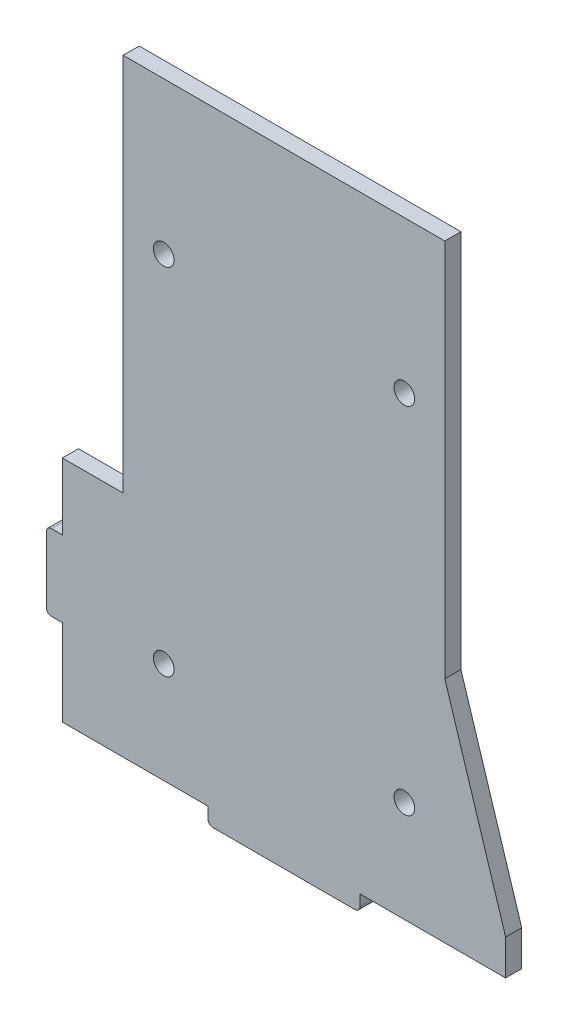
ISO-10303-21;
HEADER;
FILE_DESCRIPTION(('STEP AP214'),'2;1');
FILE_NAME('part.step','',(''),(''),'','','');
FILE_SCHEMA(('AUTOMOTIVE_DESIGN { 1 0 10303 214 1 1 1 1 }'));
ENDSEC;
DATA;
#1=APPLICATION_CONTEXT('core data for automotive mechanical design processes');
#2=APPLICATION_PROTOCOL_DEFINITION('international standard','automotive_design',2000,#1);
#3=PRODUCT_CONTEXT('',#1,'mechanical');
#4=PRODUCT('Part','Part','',(#3));
#5=PRODUCT_RELATED_PRODUCT_CATEGORY('part','',(#4));
#6=PRODUCT_DEFINITION_FORMATION('','',#4);
#7=PRODUCT_DEFINITION_CONTEXT('part definition',#1,'design');
#8=PRODUCT_DEFINITION('design','',#6,#7);
#9=PRODUCT_DEFINITION_SHAPE('','',#8);
#10=(LENGTH_UNIT() NAMED_UNIT(*) SI_UNIT(.MILLI.,.METRE.));
#11=(NAMED_UNIT(*) PLANE_ANGLE_UNIT() SI_UNIT($,.RADIAN.));
#12=(NAMED_UNIT(*) SI_UNIT($,.STERADIAN.) SOLID_ANGLE_UNIT());
#13=UNCERTAINTY_MEASURE_WITH_UNIT(LENGTH_MEASURE(1.E-05),#10,'distance_accuracy_value','');
#14=(GEOMETRIC_REPRESENTATION_CONTEXT(3) GLOBAL_UNCERTAINTY_ASSIGNED_CONTEXT((#13)) GLOBAL_UNIT_ASSIGNED_CONTEXT((#10,
#11,#12)) REPRESENTATION_CONTEXT('',''));
#15=CARTESIAN_POINT('',(0.,0.,0.));
#16=DIRECTION('',(0.,0.,1.));
#17=DIRECTION('',(1.,0.,0.));
#18=AXIS2_PLACEMENT_3D('',#15,#16,#17);
#19=CARTESIAN_POINT('',(-43.75,-53.,3.175));
#20=DIRECTION('',(1.,0.,0.));
#21=DIRECTION('',(0.,0.,-1.));
#22=AXIS2_PLACEMENT_3D('',#19,#20,#21);
#23=PLANE('',#22);
#24=DIRECTION('',(0.,0.,-1.));
#25=VECTOR('',#24,1.);
#26=CARTESIAN_POINT('',(-43.75,-28.,0.));
#27=LINE('',#26,#25);
#28=CARTESIAN_POINT('',(-43.75,-28.,3.175));
#29=VERTEX_POINT('',#28);
#30=CARTESIAN_POINT('',(-43.75,-28.,0.));
#31=VERTEX_POINT('',#30);
#32=EDGE_CURVE('E208',#29,#31,#27,.T.);
#33=ORIENTED_EDGE('',*,*,#32,.F.);
#34=DIRECTION('',(0.,-1.,0.));
#35=VECTOR('',#34,1.);
#36=CARTESIAN_POINT('',(-43.75,-14.8424319433222,3.175));
#37=LINE('',#36,#35);
#38=CARTESIAN_POINT('',(-43.75,-14.8424319433222,3.175));
#39=VERTEX_POINT('',#38);
#40=EDGE_CURVE('E202',#39,#29,#37,.T.);
#41=ORIENTED_EDGE('',*,*,#40,.F.);
#42=DIRECTION('',(0.,0.,-1.));
#43=VECTOR('',#42,1.);
#44=CARTESIAN_POINT('',(-43.75,-14.8424319433222,3.175));
#45=LINE('',#44,#43);
#46=CARTESIAN_POINT('',(-43.75,-14.8424319433222,0.));
#47=VERTEX_POINT('',#46);
#48=EDGE_CURVE('E355',#39,#47,#45,.T.);
#49=ORIENTED_EDGE('',*,*,#48,.T.);
#50=DIRECTION('',(0.,-1.,0.));
#51=VECTOR('',#50,1.);
#52=CARTESIAN_POINT('',(-43.75,-53.,0.));
#53=LINE('',#52,#51);
#54=EDGE_CURVE('E309',#47,#31,#53,.T.);
#55=ORIENTED_EDGE('',*,*,#54,.T.);
#56=EDGE_LOOP('',(#33,#41,#49,#55));
#57=FACE_BOUND('',#56,.T.);
#58=ADVANCED_FACE('F44',(#57),#23,.F.);
#59=DIRECTION('',(0.,0.,1.));
#60=VECTOR('',#59,1.);
#61=CARTESIAN_POINT('',(-43.75,-43.,0.));
#62=LINE('',#61,#60);
#63=CARTESIAN_POINT('',(-43.75,-43.,0.));
#64=VERTEX_POINT('',#63);
#65=CARTESIAN_POINT('',(-43.75,-43.,3.175));
#66=VERTEX_POINT('',#65);
#67=EDGE_CURVE('E196',#64,#66,#62,.T.);
#68=ORIENTED_EDGE('',*,*,#67,.F.);
#69=CARTESIAN_POINT('',(-43.75,-60.,0.));
#70=VERTEX_POINT('',#69);
#71=EDGE_CURVE('E308',#64,#70,#53,.T.);
#72=ORIENTED_EDGE('',*,*,#71,.T.);
#73=DIRECTION('',(0.,0.,-1.));
#74=VECTOR('',#73,1.);
#75=CARTESIAN_POINT('',(-43.75,-60.,3.175));
#76=LINE('',#75,#74);
#77=CARTESIAN_POINT('',(-43.75,-60.,3.175));
#78=VERTEX_POINT('',#77);
#79=EDGE_CURVE('E199',#78,#70,#76,.T.);
#80=ORIENTED_EDGE('',*,*,#79,.F.);
#81=EDGE_CURVE('E184',#66,#78,#37,.T.);
#82=ORIENTED_EDGE('',*,*,#81,.F.);
#83=EDGE_LOOP('',(#68,#72,#80,#82));
#84=FACE_BOUND('',#83,.T.);
#85=ADVANCED_FACE('F195',(#84),#23,.F.);
#86=CARTESIAN_POINT('',(31.75,-14.8424319433222,3.175));
#87=DIRECTION('',(-1.,0.,0.));
#88=DIRECTION('',(0.,0.,1.));
#89=AXIS2_PLACEMENT_3D('',#86,#87,#88);
#90=PLANE('',#89);
#91=DIRECTION('',(0.,1.,0.));
#92=VECTOR('',#91,1.);
#93=CARTESIAN_POINT('',(31.75,-14.8424319433222,0.));
#94=LINE('',#93,#92);
#95=CARTESIAN_POINT('',(31.75,-14.8424319433222,0.));
#96=VERTEX_POINT('',#95);
#97=CARTESIAN_POINT('',(31.75,60.,0.));
#98=VERTEX_POINT('',#97);
#99=EDGE_CURVE('E254',#96,#98,#94,.T.);
#100=ORIENTED_EDGE('',*,*,#99,.T.);
#101=DIRECTION('',(0.,0.,-1.));
#102=VECTOR('',#101,1.);
#103=CARTESIAN_POINT('',(31.75,60.,3.175));
#104=LINE('',#103,#102);
#105=CARTESIAN_POINT('',(31.75,60.,3.175));
#106=VERTEX_POINT('',#105);
#107=EDGE_CURVE('E367',#106,#98,#104,.T.);
#108=ORIENTED_EDGE('',*,*,#107,.F.);
#109=DIRECTION('',(0.,1.,0.));
#110=VECTOR('',#109,1.);
#111=CARTESIAN_POINT('',(31.75,-14.8424319433222,3.175));
#112=LINE('',#111,#110);
#113=CARTESIAN_POINT('',(31.75,-14.8424319433222,3.175));
#114=VERTEX_POINT('',#113);
#115=EDGE_CURVE('E258',#114,#106,#112,.T.);
#116=ORIENTED_EDGE('',*,*,#115,.F.);
#117=DIRECTION('',(0.,0.,-1.));
#118=VECTOR('',#117,1.);
#119=CARTESIAN_POINT('',(31.75,-14.8424319433222,3.175));
#120=LINE('',#119,#118);
#121=EDGE_CURVE('E294',#114,#96,#120,.T.);
#122=ORIENTED_EDGE('',*,*,#121,.T.);
#123=EDGE_LOOP('',(#100,#108,#116,#122));
#124=FACE_BOUND('',#123,.T.);
#125=ADVANCED_FACE('F474',(#124),#90,.F.);
#126=CARTESIAN_POINT('',(-31.75,60.,3.175));
#127=DIRECTION('',(0.,-1.,0.));
#128=DIRECTION('',(0.,0.,-1.));
#129=AXIS2_PLACEMENT_3D('',#126,#127,#128);
#130=PLANE('',#129);
#131=DIRECTION('',(-1.,0.,0.));
#132=VECTOR('',#131,1.);
#133=CARTESIAN_POINT('',(-31.75,60.,0.));
#134=LINE('',#133,#132);
#135=CARTESIAN_POINT('',(-31.75,60.,0.));
#136=VERTEX_POINT('',#135);
#137=EDGE_CURVE('E298',#98,#136,#134,.T.);
#138=ORIENTED_EDGE('',*,*,#137,.T.);
#139=DIRECTION('',(0.,0.,-1.));
#140=VECTOR('',#139,1.);
#141=CARTESIAN_POINT('',(-31.75,60.,3.175));
#142=LINE('',#141,#140);
#143=CARTESIAN_POINT('',(-31.75,60.,3.175));
#144=VERTEX_POINT('',#143);
#145=EDGE_CURVE('E363',#144,#136,#142,.T.);
#146=ORIENTED_EDGE('',*,*,#145,.F.);
#147=DIRECTION('',(-1.,0.,0.));
#148=VECTOR('',#147,1.);
#149=CARTESIAN_POINT('',(-31.75,60.,3.175));
#150=LINE('',#149,#148);
#151=EDGE_CURVE('E262',#106,#144,#150,.T.);
#152=ORIENTED_EDGE('',*,*,#151,.F.);
#153=ORIENTED_EDGE('',*,*,#107,.T.);
#154=EDGE_LOOP('',(#138,#146,#152,#153));
#155=FACE_BOUND('',#154,.T.);
#156=ADVANCED_FACE('F477',(#155),#130,.F.);
#157=CARTESIAN_POINT('',(-31.75,-14.8424319433222,3.175));
#158=DIRECTION('',(1.,0.,0.));
#159=DIRECTION('',(0.,0.,-1.));
#160=AXIS2_PLACEMENT_3D('',#157,#158,#159);
#161=PLANE('',#160);
#162=DIRECTION('',(0.,-1.,0.));
#163=VECTOR('',#162,1.);
#164=CARTESIAN_POINT('',(-31.75,-14.8424319433222,0.));
#165=LINE('',#164,#163);
#166=CARTESIAN_POINT('',(-31.75,-14.8424319433222,0.));
#167=VERTEX_POINT('',#166);
#168=EDGE_CURVE('E301',#136,#167,#165,.T.);
#169=ORIENTED_EDGE('',*,*,#168,.T.);
#170=DIRECTION('',(0.,0.,-1.));
#171=VECTOR('',#170,1.);
#172=CARTESIAN_POINT('',(-31.75,-14.8424319433222,3.175));
#173=LINE('',#172,#171);
#174=CARTESIAN_POINT('',(-31.75,-14.8424319433222,3.175));
#175=VERTEX_POINT('',#174);
#176=EDGE_CURVE('E359',#175,#167,#173,.T.);
#177=ORIENTED_EDGE('',*,*,#176,.F.);
#178=DIRECTION('',(0.,-1.,0.));
#179=VECTOR('',#178,1.);
#180=CARTESIAN_POINT('',(-31.75,-14.8424319433222,3.175));
#181=LINE('',#180,#179);
#182=EDGE_CURVE('E266',#144,#175,#181,.T.);
#183=ORIENTED_EDGE('',*,*,#182,.F.);
#184=ORIENTED_EDGE('',*,*,#145,.T.);
#185=EDGE_LOOP('',(#169,#177,#183,#184));
#186=FACE_BOUND('',#185,.T.);
#187=ADVANCED_FACE('F482',(#186),#161,.F.);
#188=CARTESIAN_POINT('',(-31.75,-14.8424319433222,3.175));
#189=DIRECTION('',(0.,-1.,0.));
#190=DIRECTION('',(0.,0.,-1.));
#191=AXIS2_PLACEMENT_3D('',#188,#189,#190);
#192=PLANE('',#191);
#193=DIRECTION('',(-1.,0.,0.));
#194=VECTOR('',#193,1.);
#195=CARTESIAN_POINT('',(-31.75,-14.8424319433222,0.));
#196=LINE('',#195,#194);
#197=EDGE_CURVE('E304',#167,#47,#196,.T.);
#198=ORIENTED_EDGE('',*,*,#197,.T.);
#199=ORIENTED_EDGE('',*,*,#48,.F.);
#200=DIRECTION('',(-1.,0.,0.));
#201=VECTOR('',#200,1.);
#202=CARTESIAN_POINT('',(-31.75,-14.8424319433222,3.175));
#203=LINE('',#202,#201);
#204=EDGE_CURVE('E203',#175,#39,#203,.T.);
#205=ORIENTED_EDGE('',*,*,#204,.F.);
#206=ORIENTED_EDGE('',*,*,#176,.T.);
#207=EDGE_LOOP('',(#198,#199,#205,#206));
#208=FACE_BOUND('',#207,.T.);
#209=ADVANCED_FACE('F487',(#208),#192,.F.);
#210=CARTESIAN_POINT('',(-31.75,-60.,3.175));
#211=DIRECTION('',(0.,1.,0.));
#212=DIRECTION('',(0.,0.,1.));
#213=AXIS2_PLACEMENT_3D('',#210,#211,#212);
#214=PLANE('',#213);
#215=DIRECTION('',(1.,0.,0.));
#216=VECTOR('',#215,1.);
#217=CARTESIAN_POINT('',(-31.75,-60.,0.));
#218=LINE('',#217,#216);
#219=CARTESIAN_POINT('',(-15.,-60.,0.));
#220=VERTEX_POINT('',#219);
#221=EDGE_CURVE('E313',#70,#220,#218,.T.);
#222=ORIENTED_EDGE('',*,*,#221,.T.);
#223=DIRECTION('',(0.,0.,-1.));
#224=VECTOR('',#223,1.);
#225=CARTESIAN_POINT('',(-15.,-60.,3.175));
#226=LINE('',#225,#224);
#227=CARTESIAN_POINT('',(-15.,-60.,3.175));
#228=VERTEX_POINT('',#227);
#229=EDGE_CURVE('E349',#228,#220,#226,.T.);
#230=ORIENTED_EDGE('',*,*,#229,.F.);
#231=DIRECTION('',(1.,0.,0.));
#232=VECTOR('',#231,1.);
#233=CARTESIAN_POINT('',(-43.75,-60.,3.175));
#234=LINE('',#233,#232);
#235=EDGE_CURVE('E273',#78,#228,#234,.T.);
#236=ORIENTED_EDGE('',*,*,#235,.F.);
#237=ORIENTED_EDGE('',*,*,#79,.T.);
#238=EDGE_LOOP('',(#222,#230,#236,#237));
#239=FACE_BOUND('',#238,.T.);
#240=ADVANCED_FACE('F437',(#239),#214,.F.);
#241=CARTESIAN_POINT('',(-15.,-60.,3.175));
#242=DIRECTION('',(1.,0.,0.));
#243=DIRECTION('',(0.,1.,0.));
#244=AXIS2_PLACEMENT_3D('',#241,#242,#243);
#245=PLANE('',#244);
#246=DIRECTION('',(0.,-1.,0.));
#247=VECTOR('',#246,1.);
#248=CARTESIAN_POINT('',(-15.,-60.,0.));
#249=LINE('',#248,#247);
#250=CARTESIAN_POINT('',(-15.,-62.175,0.));
#251=VERTEX_POINT('',#250);
#252=EDGE_CURVE('E316',#220,#251,#249,.T.);
#253=ORIENTED_EDGE('',*,*,#252,.T.);
#254=DIRECTION('',(0.,0.,-1.));
#255=VECTOR('',#254,1.);
#256=CARTESIAN_POINT('',(-15.,-62.175,3.175));
#257=LINE('',#256,#255);
#258=CARTESIAN_POINT('',(-15.,-62.175,3.175));
#259=VERTEX_POINT('',#258);
#260=EDGE_CURVE('E60',#251,#259,#257,.F.);
#261=ORIENTED_EDGE('',*,*,#260,.T.);
#262=DIRECTION('',(0.,-1.,0.));
#263=VECTOR('',#262,1.);
#264=CARTESIAN_POINT('',(-15.,-60.,3.175));
#265=LINE('',#264,#263);
#266=EDGE_CURVE('E276',#228,#259,#265,.T.);
#267=ORIENTED_EDGE('',*,*,#266,.F.);
#268=ORIENTED_EDGE('',*,*,#229,.T.);
#269=EDGE_LOOP('',(#253,#261,#267,#268));
#270=FACE_BOUND('',#269,.T.);
#271=ADVANCED_FACE('F663',(#270),#245,.F.);
#272=CARTESIAN_POINT('',(15.,-63.175,3.175));
#273=DIRECTION('',(0.,1.,0.));
#274=DIRECTION('',(0.,0.,1.));
#275=AXIS2_PLACEMENT_3D('',#272,#273,#274);
#276=PLANE('',#275);
#277=DIRECTION('',(1.,0.,0.));
#278=VECTOR('',#277,1.);
#279=CARTESIAN_POINT('',(15.,-63.175,0.));
#280=LINE('',#279,#278);
#281=CARTESIAN_POINT('',(-14.,-63.175,0.));
#282=VERTEX_POINT('',#281);
#283=CARTESIAN_POINT('',(14.,-63.175,0.));
#284=VERTEX_POINT('',#283);
#285=EDGE_CURVE('E319',#282,#284,#280,.T.);
#286=ORIENTED_EDGE('',*,*,#285,.T.);
#287=DIRECTION('',(0.,0.,-1.));
#288=VECTOR('',#287,1.);
#289=CARTESIAN_POINT('',(14.,-63.175,3.175));
#290=LINE('',#289,#288);
#291=CARTESIAN_POINT('',(14.,-63.175,3.175));
#292=VERTEX_POINT('',#291);
#293=EDGE_CURVE('E391',#284,#292,#290,.F.);
#294=ORIENTED_EDGE('',*,*,#293,.T.);
#295=DIRECTION('',(1.,0.,0.));
#296=VECTOR('',#295,1.);
#297=CARTESIAN_POINT('',(15.,-63.175,3.175));
#298=LINE('',#297,#296);
#299=CARTESIAN_POINT('',(-14.,-63.175,3.175));
#300=VERTEX_POINT('',#299);
#301=EDGE_CURVE('E279',#300,#292,#298,.T.);
#302=ORIENTED_EDGE('',*,*,#301,.F.);
#303=DIRECTION('',(0.,0.,-1.));
#304=VECTOR('',#303,1.);
#305=CARTESIAN_POINT('',(-14.,-63.175,3.175));
#306=LINE('',#305,#304);
#307=EDGE_CURVE('E387',#300,#282,#306,.T.);
#308=ORIENTED_EDGE('',*,*,#307,.T.);
#309=EDGE_LOOP('',(#286,#294,#302,#308));
#310=FACE_BOUND('',#309,.T.);
#311=ADVANCED_FACE('F445',(#310),#276,.F.);
#312=CARTESIAN_POINT('',(15.,-60.,3.175));
#313=DIRECTION('',(-1.,0.,0.));
#314=DIRECTION('',(0.,-1.,0.));
#315=AXIS2_PLACEMENT_3D('',#312,#313,#314);
#316=PLANE('',#315);
#317=DIRECTION('',(0.,1.,0.));
#318=VECTOR('',#317,1.);
#319=CARTESIAN_POINT('',(15.,-60.,3.175));
#320=LINE('',#319,#318);
#321=CARTESIAN_POINT('',(15.,-62.175,3.175));
#322=VERTEX_POINT('',#321);
#323=CARTESIAN_POINT('',(15.,-60.,3.175));
#324=VERTEX_POINT('',#323);
#325=EDGE_CURVE('E282',#322,#324,#320,.T.);
#326=ORIENTED_EDGE('',*,*,#325,.F.);
#327=DIRECTION('',(0.,0.,-1.));
#328=VECTOR('',#327,1.);
#329=CARTESIAN_POINT('',(15.,-62.175,3.175));
#330=LINE('',#329,#328);
#331=CARTESIAN_POINT('',(15.,-62.175,0.));
#332=VERTEX_POINT('',#331);
#333=EDGE_CURVE('E371',#322,#332,#330,.T.);
#334=ORIENTED_EDGE('',*,*,#333,.T.);
#335=DIRECTION('',(0.,1.,0.));
#336=VECTOR('',#335,1.);
#337=CARTESIAN_POINT('',(15.,-60.,0.));
#338=LINE('',#337,#336);
#339=CARTESIAN_POINT('',(15.,-60.,0.));
#340=VERTEX_POINT('',#339);
#341=EDGE_CURVE('E323',#332,#340,#338,.T.);
#342=ORIENTED_EDGE('',*,*,#341,.T.);
#343=DIRECTION('',(0.,0.,-1.));
#344=VECTOR('',#343,1.);
#345=CARTESIAN_POINT('',(15.,-60.,3.175));
#346=LINE('',#345,#344);
#347=EDGE_CURVE('E345',#324,#340,#346,.T.);
#348=ORIENTED_EDGE('',*,*,#347,.F.);
#349=EDGE_LOOP('',(#326,#334,#342,#348));
#350=FACE_BOUND('',#349,.T.);
#351=ADVANCED_FACE('F454',(#350),#316,.F.);
#352=CARTESIAN_POINT('',(43.75,-60.,3.175));
#353=DIRECTION('',(0.,1.,0.));
#354=DIRECTION('',(-1.,0.,0.));
#355=AXIS2_PLACEMENT_3D('',#352,#353,#354);
#356=PLANE('',#355);
#357=DIRECTION('',(1.,0.,0.));
#358=VECTOR('',#357,1.);
#359=CARTESIAN_POINT('',(43.75,-60.,0.));
#360=LINE('',#359,#358);
#361=CARTESIAN_POINT('',(43.75,-60.,0.));
#362=VERTEX_POINT('',#361);
#363=EDGE_CURVE('E326',#340,#362,#360,.T.);
#364=ORIENTED_EDGE('',*,*,#363,.T.);
#365=DIRECTION('',(0.,0.,-1.));
#366=VECTOR('',#365,1.);
#367=CARTESIAN_POINT('',(43.75,-60.,3.175));
#368=LINE('',#367,#366);
#369=CARTESIAN_POINT('',(43.75,-60.,3.175));
#370=VERTEX_POINT('',#369);
#371=EDGE_CURVE('E341',#370,#362,#368,.T.);
#372=ORIENTED_EDGE('',*,*,#371,.F.);
#373=DIRECTION('',(1.,0.,0.));
#374=VECTOR('',#373,1.);
#375=CARTESIAN_POINT('',(15.,-60.,3.175));
#376=LINE('',#375,#374);
#377=EDGE_CURVE('E285',#324,#370,#376,.T.);
#378=ORIENTED_EDGE('',*,*,#377,.F.);
#379=ORIENTED_EDGE('',*,*,#347,.T.);
#380=EDGE_LOOP('',(#364,#372,#378,#379));
#381=FACE_BOUND('',#380,.T.);
#382=ADVANCED_FACE('F461',(#381),#356,.F.);
#383=CARTESIAN_POINT('',(43.75,-53.,3.175));
#384=DIRECTION('',(-1.,0.,0.));
#385=DIRECTION('',(0.,0.,1.));
#386=AXIS2_PLACEMENT_3D('',#383,#384,#385);
#387=PLANE('',#386);
#388=DIRECTION('',(0.,1.,0.));
#389=VECTOR('',#388,1.);
#390=CARTESIAN_POINT('',(43.75,-53.,0.));
#391=LINE('',#390,#389);
#392=CARTESIAN_POINT('',(43.75,-53.,0.));
#393=VERTEX_POINT('',#392);
#394=EDGE_CURVE('E329',#362,#393,#391,.T.);
#395=ORIENTED_EDGE('',*,*,#394,.T.);
#396=DIRECTION('',(0.,0.,-1.));
#397=VECTOR('',#396,1.);
#398=CARTESIAN_POINT('',(43.75,-53.,3.175));
#399=LINE('',#398,#397);
#400=CARTESIAN_POINT('',(43.75,-53.,3.175));
#401=VERTEX_POINT('',#400);
#402=EDGE_CURVE('E337',#401,#393,#399,.T.);
#403=ORIENTED_EDGE('',*,*,#402,.F.);
#404=DIRECTION('',(0.,1.,0.));
#405=VECTOR('',#404,1.);
#406=CARTESIAN_POINT('',(43.75,-53.,3.175));
#407=LINE('',#406,#405);
#408=EDGE_CURVE('E288',#370,#401,#407,.T.);
#409=ORIENTED_EDGE('',*,*,#408,.F.);
#410=ORIENTED_EDGE('',*,*,#371,.T.);
#411=EDGE_LOOP('',(#395,#403,#409,#410));
#412=FACE_BOUND('',#411,.T.);
#413=ADVANCED_FACE('F464',(#412),#387,.F.);
#414=CARTESIAN_POINT('',(43.75,-53.,3.175));
#415=DIRECTION('',(-0.953939201416946,-0.3,0.));
#416=DIRECTION('',(0.3,-0.953939201416946,0.));
#417=AXIS2_PLACEMENT_3D('',#414,#415,#416);
#418=PLANE('',#417);
#419=DIRECTION('',(-0.3,0.953939201416946,0.));
#420=VECTOR('',#419,1.);
#421=CARTESIAN_POINT('',(43.75,-53.,0.));
#422=LINE('',#421,#420);
#423=EDGE_CURVE('E263',#393,#96,#422,.T.);
#424=ORIENTED_EDGE('',*,*,#423,.T.);
#425=ORIENTED_EDGE('',*,*,#121,.F.);
#426=DIRECTION('',(-0.3,0.953939201416946,0.));
#427=VECTOR('',#426,1.);
#428=CARTESIAN_POINT('',(43.75,-53.,3.175));
#429=LINE('',#428,#427);
#430=EDGE_CURVE('E291',#401,#114,#429,.T.);
#431=ORIENTED_EDGE('',*,*,#430,.F.);
#432=ORIENTED_EDGE('',*,*,#402,.T.);
#433=EDGE_LOOP('',(#424,#425,#431,#432));
#434=FACE_BOUND('',#433,.T.);
#435=ADVANCED_FACE('F469',(#434),#418,.F.);
#436=CARTESIAN_POINT('',(0.,0.,3.175));
#437=DIRECTION('',(0.,0.,-1.));
#438=DIRECTION('',(-1.,0.,0.));
#439=AXIS2_PLACEMENT_3D('',#436,#437,#438);
#440=PLANE('',#439);
#441=CARTESIAN_POINT('',(-23.75,30.,3.175));
#442=DIRECTION('',(0.,0.,1.));
#443=DIRECTION('',(-1.,0.,0.));
#444=AXIS2_PLACEMENT_3D('',#441,#442,#443);
#445=CIRCLE('',#444,2.05);
#446=CARTESIAN_POINT('',(-25.8,30.,3.175));
#447=VERTEX_POINT('',#446);
#448=EDGE_CURVE('E243',#447,#447,#445,.T.);
#449=ORIENTED_EDGE('',*,*,#448,.F.);
#450=EDGE_LOOP('',(#449));
#451=FACE_BOUND('',#450,.T.);
#452=CARTESIAN_POINT('',(-23.75,-40.,3.175));
#453=DIRECTION('',(0.,0.,1.));
#454=DIRECTION('',(-1.,0.,0.));
#455=AXIS2_PLACEMENT_3D('',#452,#453,#454);
#456=CIRCLE('',#455,2.05);
#457=CARTESIAN_POINT('',(-25.8,-40.,3.175));
#458=VERTEX_POINT('',#457);
#459=EDGE_CURVE('E235',#458,#458,#456,.T.);
#460=ORIENTED_EDGE('',*,*,#459,.F.);
#461=EDGE_LOOP('',(#460));
#462=FACE_BOUND('',#461,.T.);
#463=CARTESIAN_POINT('',(23.75,-40.,3.175));
#464=DIRECTION('',(0.,0.,1.));
#465=DIRECTION('',(1.,0.,0.));
#466=AXIS2_PLACEMENT_3D('',#463,#464,#465);
#467=CIRCLE('',#466,2.05);
#468=CARTESIAN_POINT('',(25.8,-40.,3.175));
#469=VERTEX_POINT('',#468);
#470=EDGE_CURVE('E226',#469,#469,#467,.T.);
#471=ORIENTED_EDGE('',*,*,#470,.F.);
#472=EDGE_LOOP('',(#471));
#473=FACE_BOUND('',#472,.T.);
#474=CARTESIAN_POINT('',(23.75,30.,3.175));
#475=DIRECTION('',(0.,0.,1.));
#476=DIRECTION('',(1.,0.,0.));
#477=AXIS2_PLACEMENT_3D('',#474,#475,#476);
#478=CIRCLE('',#477,2.05);
#479=CARTESIAN_POINT('',(25.8,30.,3.175));
#480=VERTEX_POINT('',#479);
#481=EDGE_CURVE('E230',#480,#480,#478,.T.);
#482=ORIENTED_EDGE('',*,*,#481,.F.);
#483=EDGE_LOOP('',(#482));
#484=FACE_BOUND('',#483,.T.);
#485=ORIENTED_EDGE('',*,*,#301,.T.);
#486=CARTESIAN_POINT('',(14.,-62.175,3.175));
#487=DIRECTION('',(0.,0.,-1.));
#488=DIRECTION('',(-1.,0.,0.));
#489=AXIS2_PLACEMENT_3D('',#486,#487,#488);
#490=CIRCLE('',#489,1.);
#491=EDGE_CURVE('E402',#292,#322,#490,.F.);
#492=ORIENTED_EDGE('',*,*,#491,.T.);
#493=ORIENTED_EDGE('',*,*,#325,.T.);
#494=ORIENTED_EDGE('',*,*,#377,.T.);
#495=ORIENTED_EDGE('',*,*,#408,.T.);
#496=ORIENTED_EDGE('',*,*,#430,.T.);
#497=ORIENTED_EDGE('',*,*,#115,.T.);
#498=ORIENTED_EDGE('',*,*,#151,.T.);
#499=ORIENTED_EDGE('',*,*,#182,.T.);
#500=ORIENTED_EDGE('',*,*,#204,.T.);
#501=ORIENTED_EDGE('',*,*,#40,.T.);
#502=DIRECTION('',(1.,0.,0.));
#503=VECTOR('',#502,1.);
#504=CARTESIAN_POINT('',(-46.925,-28.,3.175));
#505=LINE('',#504,#503);
#506=CARTESIAN_POINT('',(-45.925,-28.,3.175));
#507=VERTEX_POINT('',#506);
#508=EDGE_CURVE('E191',#507,#29,#505,.T.);
#509=ORIENTED_EDGE('',*,*,#508,.F.);
#510=CARTESIAN_POINT('',(-45.925,-29.,3.175));
#511=DIRECTION('',(0.,0.,-1.));
#512=DIRECTION('',(-1.,0.,0.));
#513=AXIS2_PLACEMENT_3D('',#510,#511,#512);
#514=CIRCLE('',#513,1.);
#515=CARTESIAN_POINT('',(-46.925,-29.,3.175));
#516=VERTEX_POINT('',#515);
#517=EDGE_CURVE('E394',#507,#516,#514,.F.);
#518=ORIENTED_EDGE('',*,*,#517,.T.);
#519=DIRECTION('',(0.,1.,0.));
#520=VECTOR('',#519,1.);
#521=CARTESIAN_POINT('',(-46.925,-43.,3.175));
#522=LINE('',#521,#520);
#523=CARTESIAN_POINT('',(-46.925,-42.,3.175));
#524=VERTEX_POINT('',#523);
#525=EDGE_CURVE('E215',#524,#516,#522,.T.);
#526=ORIENTED_EDGE('',*,*,#525,.F.);
#527=CARTESIAN_POINT('',(-45.925,-42.,3.175));
#528=DIRECTION('',(0.,0.,-1.));
#529=DIRECTION('',(-1.,0.,0.));
#530=AXIS2_PLACEMENT_3D('',#527,#528,#529);
#531=CIRCLE('',#530,1.);
#532=CARTESIAN_POINT('',(-45.925,-43.,3.175));
#533=VERTEX_POINT('',#532);
#534=EDGE_CURVE('E68',#524,#533,#531,.F.);
#535=ORIENTED_EDGE('',*,*,#534,.T.);
#536=DIRECTION('',(1.,0.,0.));
#537=VECTOR('',#536,1.);
#538=CARTESIAN_POINT('',(-46.925,-43.,3.175));
#539=LINE('',#538,#537);
#540=EDGE_CURVE('E180',#533,#66,#539,.T.);
#541=ORIENTED_EDGE('',*,*,#540,.T.);
#542=ORIENTED_EDGE('',*,*,#81,.T.);
#543=ORIENTED_EDGE('',*,*,#235,.T.);
#544=ORIENTED_EDGE('',*,*,#266,.T.);
#545=CARTESIAN_POINT('',(-14.,-62.175,3.175));
#546=DIRECTION('',(0.,0.,-1.));
#547=DIRECTION('',(-1.,0.,0.));
#548=AXIS2_PLACEMENT_3D('',#545,#546,#547);
#549=CIRCLE('',#548,1.);
#550=EDGE_CURVE('E399',#259,#300,#549,.F.);
#551=ORIENTED_EDGE('',*,*,#550,.T.);
#552=EDGE_LOOP('',(#485,#492,#493,#494,#495,#496,#497,#498,#499,#500,#501,#509,#518,#526,#535,
#541,#542,#543,#544,#551));
#553=FACE_BOUND('',#552,.T.);
#554=ADVANCED_FACE('F183',(#451,#462,#473,#484,#553),#440,.F.);
#555=CARTESIAN_POINT('',(0.,0.,0.));
#556=DIRECTION('',(0.,0.,-1.));
#557=DIRECTION('',(-1.,0.,0.));
#558=AXIS2_PLACEMENT_3D('',#555,#556,#557);
#559=PLANE('',#558);
#560=CARTESIAN_POINT('',(-23.75,30.,0.));
#561=DIRECTION('',(0.,0.,1.));
#562=DIRECTION('',(-1.,0.,0.));
#563=AXIS2_PLACEMENT_3D('',#560,#561,#562);
#564=CIRCLE('',#563,2.05);
#565=CARTESIAN_POINT('',(-25.8,30.,0.));
#566=VERTEX_POINT('',#565);
#567=EDGE_CURVE('E225',#566,#566,#564,.T.);
#568=ORIENTED_EDGE('',*,*,#567,.T.);
#569=EDGE_LOOP('',(#568));
#570=FACE_BOUND('',#569,.T.);
#571=CARTESIAN_POINT('',(-23.75,-40.,0.));
#572=DIRECTION('',(0.,0.,1.));
#573=DIRECTION('',(-1.,0.,0.));
#574=AXIS2_PLACEMENT_3D('',#571,#572,#573);
#575=CIRCLE('',#574,2.05);
#576=CARTESIAN_POINT('',(-25.8,-40.,0.));
#577=VERTEX_POINT('',#576);
#578=EDGE_CURVE('E239',#577,#577,#575,.T.);
#579=ORIENTED_EDGE('',*,*,#578,.T.);
#580=EDGE_LOOP('',(#579));
#581=FACE_BOUND('',#580,.T.);
#582=CARTESIAN_POINT('',(23.75,-40.,0.));
#583=DIRECTION('',(0.,0.,1.));
#584=DIRECTION('',(1.,0.,0.));
#585=AXIS2_PLACEMENT_3D('',#582,#583,#584);
#586=CIRCLE('',#585,2.05);
#587=CARTESIAN_POINT('',(25.8,-40.,0.));
#588=VERTEX_POINT('',#587);
#589=EDGE_CURVE('E231',#588,#588,#586,.T.);
#590=ORIENTED_EDGE('',*,*,#589,.T.);
#591=EDGE_LOOP('',(#590));
#592=FACE_BOUND('',#591,.T.);
#593=CARTESIAN_POINT('',(23.75,30.,0.));
#594=DIRECTION('',(0.,0.,1.));
#595=DIRECTION('',(1.,0.,0.));
#596=AXIS2_PLACEMENT_3D('',#593,#594,#595);
#597=CIRCLE('',#596,2.05);
#598=CARTESIAN_POINT('',(25.8,30.,0.));
#599=VERTEX_POINT('',#598);
#600=EDGE_CURVE('E250',#599,#599,#597,.T.);
#601=ORIENTED_EDGE('',*,*,#600,.T.);
#602=EDGE_LOOP('',(#601));
#603=FACE_BOUND('',#602,.T.);
#604=ORIENTED_EDGE('',*,*,#341,.F.);
#605=CARTESIAN_POINT('',(14.,-62.175,0.));
#606=DIRECTION('',(0.,0.,-1.));
#607=DIRECTION('',(-1.,0.,0.));
#608=AXIS2_PLACEMENT_3D('',#605,#606,#607);
#609=CIRCLE('',#608,1.);
#610=EDGE_CURVE('E384',#332,#284,#609,.T.);
#611=ORIENTED_EDGE('',*,*,#610,.T.);
#612=ORIENTED_EDGE('',*,*,#285,.F.);
#613=CARTESIAN_POINT('',(-14.,-62.175,0.));
#614=DIRECTION('',(0.,0.,-1.));
#615=DIRECTION('',(-1.,0.,0.));
#616=AXIS2_PLACEMENT_3D('',#613,#614,#615);
#617=CIRCLE('',#616,1.);
#618=EDGE_CURVE('E381',#282,#251,#617,.T.);
#619=ORIENTED_EDGE('',*,*,#618,.T.);
#620=ORIENTED_EDGE('',*,*,#252,.F.);
#621=ORIENTED_EDGE('',*,*,#221,.F.);
#622=ORIENTED_EDGE('',*,*,#71,.F.);
#623=DIRECTION('',(1.,0.,0.));
#624=VECTOR('',#623,1.);
#625=CARTESIAN_POINT('',(-46.925,-43.,0.));
#626=LINE('',#625,#624);
#627=CARTESIAN_POINT('',(-45.925,-43.,0.));
#628=VERTEX_POINT('',#627);
#629=EDGE_CURVE('E190',#628,#64,#626,.T.);
#630=ORIENTED_EDGE('',*,*,#629,.F.);
#631=CARTESIAN_POINT('',(-45.925,-42.,0.));
#632=DIRECTION('',(0.,0.,-1.));
#633=DIRECTION('',(-1.,0.,0.));
#634=AXIS2_PLACEMENT_3D('',#631,#632,#633);
#635=CIRCLE('',#634,1.);
#636=CARTESIAN_POINT('',(-46.925,-42.,0.));
#637=VERTEX_POINT('',#636);
#638=EDGE_CURVE('E378',#628,#637,#635,.T.);
#639=ORIENTED_EDGE('',*,*,#638,.T.);
#640=DIRECTION('',(0.,-1.,0.));
#641=VECTOR('',#640,1.);
#642=CARTESIAN_POINT('',(-46.925,-43.,0.));
#643=LINE('',#642,#641);
#644=CARTESIAN_POINT('',(-46.925,-29.,0.));
#645=VERTEX_POINT('',#644);
#646=EDGE_CURVE('E212',#645,#637,#643,.T.);
#647=ORIENTED_EDGE('',*,*,#646,.F.);
#648=CARTESIAN_POINT('',(-45.925,-29.,0.));
#649=DIRECTION('',(0.,0.,-1.));
#650=DIRECTION('',(-1.,0.,0.));
#651=AXIS2_PLACEMENT_3D('',#648,#649,#650);
#652=CIRCLE('',#651,1.);
#653=CARTESIAN_POINT('',(-45.925,-28.,0.));
#654=VERTEX_POINT('',#653);
#655=EDGE_CURVE('E375',#645,#654,#652,.T.);
#656=ORIENTED_EDGE('',*,*,#655,.T.);
#657=DIRECTION('',(1.,0.,0.));
#658=VECTOR('',#657,1.);
#659=CARTESIAN_POINT('',(-46.925,-28.,0.));
#660=LINE('',#659,#658);
#661=EDGE_CURVE('E218',#654,#31,#660,.T.);
#662=ORIENTED_EDGE('',*,*,#661,.T.);
#663=ORIENTED_EDGE('',*,*,#54,.F.);
#664=ORIENTED_EDGE('',*,*,#197,.F.);
#665=ORIENTED_EDGE('',*,*,#168,.F.);
#666=ORIENTED_EDGE('',*,*,#137,.F.);
#667=ORIENTED_EDGE('',*,*,#99,.F.);
#668=ORIENTED_EDGE('',*,*,#423,.F.);
#669=ORIENTED_EDGE('',*,*,#394,.F.);
#670=ORIENTED_EDGE('',*,*,#363,.F.);
#671=EDGE_LOOP('',(#604,#611,#612,#619,#620,#621,#622,#630,#639,#647,#656,#662,#663,#664,#665,
#666,#667,#668,#669,#670));
#672=FACE_BOUND('',#671,.T.);
#673=ADVANCED_FACE('F419',(#570,#581,#592,#603,#672),#559,.T.);
#674=CARTESIAN_POINT('',(23.75,30.,0.));
#675=DIRECTION('',(0.,0.,1.));
#676=DIRECTION('',(1.,0.,0.));
#677=AXIS2_PLACEMENT_3D('',#674,#675,#676);
#678=CYLINDRICAL_SURFACE('',#677,2.05);
#679=ORIENTED_EDGE('',*,*,#600,.F.);
#680=EDGE_LOOP('',(#679));
#681=FACE_BOUND('',#680,.T.);
#682=ORIENTED_EDGE('',*,*,#481,.T.);
#683=EDGE_LOOP('',(#682));
#684=FACE_BOUND('',#683,.T.);
#685=ADVANCED_FACE('F601',(#681,#684),#678,.F.);
#686=CARTESIAN_POINT('',(23.75,-40.,0.));
#687=DIRECTION('',(0.,0.,1.));
#688=DIRECTION('',(1.,0.,0.));
#689=AXIS2_PLACEMENT_3D('',#686,#687,#688);
#690=CYLINDRICAL_SURFACE('',#689,2.05);
#691=ORIENTED_EDGE('',*,*,#589,.F.);
#692=EDGE_LOOP('',(#691));
#693=FACE_BOUND('',#692,.T.);
#694=ORIENTED_EDGE('',*,*,#470,.T.);
#695=EDGE_LOOP('',(#694));
#696=FACE_BOUND('',#695,.T.);
#697=ADVANCED_FACE('F592',(#693,#696),#690,.F.);
#698=CARTESIAN_POINT('',(-23.75,-40.,0.));
#699=DIRECTION('',(0.,0.,1.));
#700=DIRECTION('',(1.,0.,0.));
#701=AXIS2_PLACEMENT_3D('',#698,#699,#700);
#702=CYLINDRICAL_SURFACE('',#701,2.05);
#703=ORIENTED_EDGE('',*,*,#578,.F.);
#704=EDGE_LOOP('',(#703));
#705=FACE_BOUND('',#704,.T.);
#706=ORIENTED_EDGE('',*,*,#459,.T.);
#707=EDGE_LOOP('',(#706));
#708=FACE_BOUND('',#707,.T.);
#709=ADVANCED_FACE('F583',(#705,#708),#702,.F.);
#710=CARTESIAN_POINT('',(-23.75,30.,0.));
#711=DIRECTION('',(0.,0.,1.));
#712=DIRECTION('',(1.,0.,0.));
#713=AXIS2_PLACEMENT_3D('',#710,#711,#712);
#714=CYLINDRICAL_SURFACE('',#713,2.05);
#715=ORIENTED_EDGE('',*,*,#567,.F.);
#716=EDGE_LOOP('',(#715));
#717=FACE_BOUND('',#716,.T.);
#718=ORIENTED_EDGE('',*,*,#448,.T.);
#719=EDGE_LOOP('',(#718));
#720=FACE_BOUND('',#719,.T.);
#721=ADVANCED_FACE('F560',(#717,#720),#714,.F.);
#722=CARTESIAN_POINT('',(-46.925,-43.,0.));
#723=DIRECTION('',(0.,1.,0.));
#724=DIRECTION('',(0.,0.,1.));
#725=AXIS2_PLACEMENT_3D('',#722,#723,#724);
#726=PLANE('',#725);
#727=ORIENTED_EDGE('',*,*,#540,.F.);
#728=DIRECTION('',(0.,0.,1.));
#729=VECTOR('',#728,1.);
#730=CARTESIAN_POINT('',(-45.925,-43.,0.));
#731=LINE('',#730,#729);
#732=EDGE_CURVE('E53',#533,#628,#731,.F.);
#733=ORIENTED_EDGE('',*,*,#732,.T.);
#734=ORIENTED_EDGE('',*,*,#629,.T.);
#735=ORIENTED_EDGE('',*,*,#67,.T.);
#736=EDGE_LOOP('',(#727,#733,#734,#735));
#737=FACE_BOUND('',#736,.T.);
#738=ADVANCED_FACE('F205',(#737),#726,.F.);
#739=CARTESIAN_POINT('',(-46.925,-28.,0.));
#740=DIRECTION('',(0.,-1.,0.));
#741=DIRECTION('',(0.,0.,-1.));
#742=AXIS2_PLACEMENT_3D('',#739,#740,#741);
#743=PLANE('',#742);
#744=ORIENTED_EDGE('',*,*,#661,.F.);
#745=DIRECTION('',(0.,0.,-1.));
#746=VECTOR('',#745,1.);
#747=CARTESIAN_POINT('',(-45.925,-28.,0.));
#748=LINE('',#747,#746);
#749=EDGE_CURVE('E11',#654,#507,#748,.F.);
#750=ORIENTED_EDGE('',*,*,#749,.T.);
#751=ORIENTED_EDGE('',*,*,#508,.T.);
#752=ORIENTED_EDGE('',*,*,#32,.T.);
#753=EDGE_LOOP('',(#744,#750,#751,#752));
#754=FACE_BOUND('',#753,.T.);
#755=ADVANCED_FACE('F493',(#754),#743,.F.);
#756=CARTESIAN_POINT('',(-46.925,0.,0.));
#757=DIRECTION('',(1.,0.,0.));
#758=DIRECTION('',(0.,0.,-1.));
#759=AXIS2_PLACEMENT_3D('',#756,#757,#758);
#760=PLANE('',#759);
#761=ORIENTED_EDGE('',*,*,#646,.T.);
#762=DIRECTION('',(0.,0.,1.));
#763=VECTOR('',#762,1.);
#764=CARTESIAN_POINT('',(-46.925,-42.,0.));
#765=LINE('',#764,#763);
#766=EDGE_CURVE('E411',#637,#524,#765,.T.);
#767=ORIENTED_EDGE('',*,*,#766,.T.);
#768=ORIENTED_EDGE('',*,*,#525,.T.);
#769=DIRECTION('',(0.,0.,-1.));
#770=VECTOR('',#769,1.);
#771=CARTESIAN_POINT('',(-46.925,-29.,0.));
#772=LINE('',#771,#770);
#773=EDGE_CURVE('E407',#516,#645,#772,.T.);
#774=ORIENTED_EDGE('',*,*,#773,.T.);
#775=EDGE_LOOP('',(#761,#767,#768,#774));
#776=FACE_BOUND('',#775,.T.);
#777=ADVANCED_FACE('F427',(#776),#760,.F.);
#778=CARTESIAN_POINT('',(14.,-62.175,3.175));
#779=DIRECTION('',(0.,0.,-1.));
#780=DIRECTION('',(-1.,0.,0.));
#781=AXIS2_PLACEMENT_3D('',#778,#779,#780);
#782=CYLINDRICAL_SURFACE('',#781,1.);
#783=ORIENTED_EDGE('',*,*,#491,.F.);
#784=ORIENTED_EDGE('',*,*,#293,.F.);
#785=ORIENTED_EDGE('',*,*,#610,.F.);
#786=ORIENTED_EDGE('',*,*,#333,.F.);
#787=EDGE_LOOP('',(#783,#784,#785,#786));
#788=FACE_BOUND('',#787,.T.);
#789=ADVANCED_FACE('F451',(#788),#782,.T.);
#790=CARTESIAN_POINT('',(-14.,-62.175,3.175));
#791=DIRECTION('',(0.,0.,-1.));
#792=DIRECTION('',(-1.,0.,0.));
#793=AXIS2_PLACEMENT_3D('',#790,#791,#792);
#794=CYLINDRICAL_SURFACE('',#793,1.);
#795=ORIENTED_EDGE('',*,*,#550,.F.);
#796=ORIENTED_EDGE('',*,*,#260,.F.);
#797=ORIENTED_EDGE('',*,*,#618,.F.);
#798=ORIENTED_EDGE('',*,*,#307,.F.);
#799=EDGE_LOOP('',(#795,#796,#797,#798));
#800=FACE_BOUND('',#799,.T.);
#801=ADVANCED_FACE('F442',(#800),#794,.T.);
#802=CARTESIAN_POINT('',(-45.925,-42.,0.));
#803=DIRECTION('',(0.,0.,1.));
#804=DIRECTION('',(1.,0.,0.));
#805=AXIS2_PLACEMENT_3D('',#802,#803,#804);
#806=CYLINDRICAL_SURFACE('',#805,1.);
#807=ORIENTED_EDGE('',*,*,#638,.F.);
#808=ORIENTED_EDGE('',*,*,#732,.F.);
#809=ORIENTED_EDGE('',*,*,#534,.F.);
#810=ORIENTED_EDGE('',*,*,#766,.F.);
#811=EDGE_LOOP('',(#807,#808,#809,#810));
#812=FACE_BOUND('',#811,.T.);
#813=ADVANCED_FACE('F424',(#812),#806,.T.);
#814=CARTESIAN_POINT('',(-45.925,-29.,0.));
#815=DIRECTION('',(0.,0.,-1.));
#816=DIRECTION('',(-1.,0.,0.));
#817=AXIS2_PLACEMENT_3D('',#814,#815,#816);
#818=CYLINDRICAL_SURFACE('',#817,1.);
#819=ORIENTED_EDGE('',*,*,#517,.F.);
#820=ORIENTED_EDGE('',*,*,#749,.F.);
#821=ORIENTED_EDGE('',*,*,#655,.F.);
#822=ORIENTED_EDGE('',*,*,#773,.F.);
#823=EDGE_LOOP('',(#819,#820,#821,#822));
#824=FACE_BOUND('',#823,.T.);
#825=ADVANCED_FACE('F46',(#824),#818,.T.);
#826=CLOSED_SHELL('',(#58,#85,#125,#156,#187,#209,#240,#271,#311,#351,#382,#413,#435,#554,#673,
#685,#697,#709,#721,#738,#755,#777,#789,#801,#813,#825));
#827=MANIFOLD_SOLID_BREP('B2',#826);
#828=ADVANCED_BREP_SHAPE_REPRESENTATION('',(#18,#827),#14);
#829=SHAPE_DEFINITION_REPRESENTATION(#9,#828);
ENDSEC;
END-ISO-10303-21;
